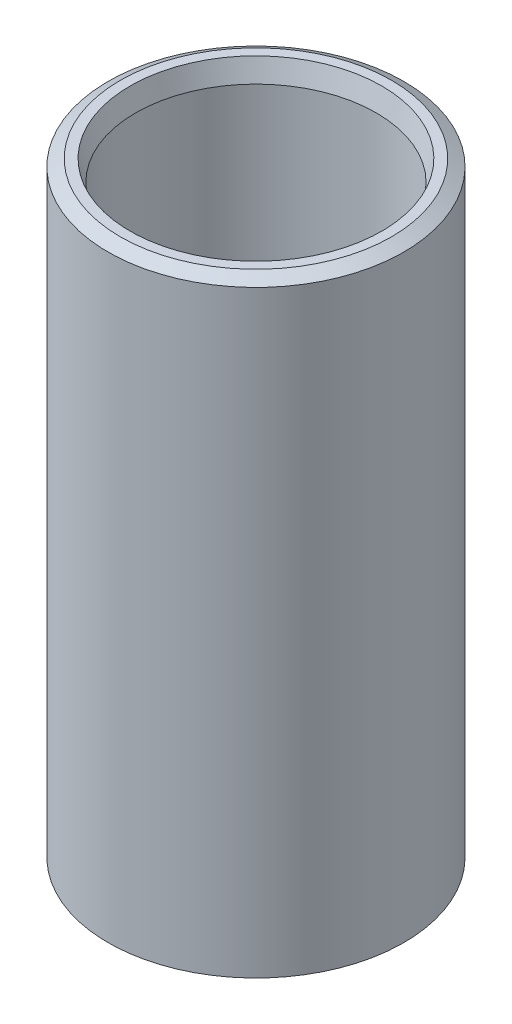
ISO-10303-21;
HEADER;
FILE_DESCRIPTION(('STEP AP214'),'2;1');
FILE_NAME('part.step','',(''),(''),'','','');
FILE_SCHEMA(('AUTOMOTIVE_DESIGN { 1 0 10303 214 1 1 1 1 }'));
ENDSEC;
DATA;
#1=APPLICATION_CONTEXT('core data for automotive mechanical design processes');
#2=APPLICATION_PROTOCOL_DEFINITION('international standard','automotive_design',2000,#1);
#3=PRODUCT_CONTEXT('',#1,'mechanical');
#4=PRODUCT('Part','Part','',(#3));
#5=PRODUCT_RELATED_PRODUCT_CATEGORY('part','',(#4));
#6=PRODUCT_DEFINITION_FORMATION('','',#4);
#7=PRODUCT_DEFINITION_CONTEXT('part definition',#1,'design');
#8=PRODUCT_DEFINITION('design','',#6,#7);
#9=PRODUCT_DEFINITION_SHAPE('','',#8);
#10=(LENGTH_UNIT() NAMED_UNIT(*) SI_UNIT(.MILLI.,.METRE.));
#11=(NAMED_UNIT(*) PLANE_ANGLE_UNIT() SI_UNIT($,.RADIAN.));
#12=(NAMED_UNIT(*) SI_UNIT($,.STERADIAN.) SOLID_ANGLE_UNIT());
#13=UNCERTAINTY_MEASURE_WITH_UNIT(LENGTH_MEASURE(1.E-05),#10,'distance_accuracy_value','');
#14=(GEOMETRIC_REPRESENTATION_CONTEXT(3) GLOBAL_UNCERTAINTY_ASSIGNED_CONTEXT((#13)) GLOBAL_UNIT_ASSIGNED_CONTEXT((#10,
#11,#12)) REPRESENTATION_CONTEXT('',''));
#15=CARTESIAN_POINT('',(0.,0.,0.));
#16=DIRECTION('',(0.,0.,1.));
#17=DIRECTION('',(1.,0.,0.));
#18=AXIS2_PLACEMENT_3D('',#15,#16,#17);
#19=CARTESIAN_POINT('',(0.,100.,0.));
#20=DIRECTION('',(0.,1.,0.));
#21=DIRECTION('',(0.,0.,1.));
#22=AXIS2_PLACEMENT_3D('',#19,#20,#21);
#23=PLANE('',#22);
#24=CARTESIAN_POINT('',(0.,100.,0.));
#25=DIRECTION('',(0.,-1.,0.));
#26=DIRECTION('',(0.,0.,-1.));
#27=AXIS2_PLACEMENT_3D('',#24,#25,#26);
#28=CIRCLE('',#27,20.55);
#29=CARTESIAN_POINT('',(0.,100.,-20.55));
#30=VERTEX_POINT('',#29);
#31=EDGE_CURVE('E43',#30,#30,#28,.T.);
#32=ORIENTED_EDGE('',*,*,#31,.T.);
#33=EDGE_LOOP('',(#32));
#34=FACE_BOUND('',#33,.T.);
#35=CARTESIAN_POINT('',(0.,100.,0.));
#36=DIRECTION('',(0.,-1.,0.));
#37=DIRECTION('',(0.,0.,-1.));
#38=AXIS2_PLACEMENT_3D('',#35,#36,#37);
#39=CIRCLE('',#38,22.15);
#40=CARTESIAN_POINT('',(0.,100.,-22.15));
#41=VERTEX_POINT('',#40);
#42=EDGE_CURVE('E39',#41,#41,#39,.T.);
#43=ORIENTED_EDGE('',*,*,#42,.F.);
#44=EDGE_LOOP('',(#43));
#45=FACE_BOUND('',#44,.T.);
#46=ADVANCED_FACE('F32',(#34,#45),#23,.T.);
#47=CARTESIAN_POINT('',(0.,0.,0.));
#48=DIRECTION('',(0.,1.,0.));
#49=DIRECTION('',(0.,0.,1.));
#50=AXIS2_PLACEMENT_3D('',#47,#48,#49);
#51=PLANE('',#50);
#52=CARTESIAN_POINT('',(0.,0.,0.));
#53=DIRECTION('',(0.,-1.,0.));
#54=DIRECTION('',(0.,0.,-1.));
#55=AXIS2_PLACEMENT_3D('',#52,#53,#54);
#56=CIRCLE('',#55,20.55);
#57=CARTESIAN_POINT('',(0.,0.,-20.55));
#58=VERTEX_POINT('',#57);
#59=EDGE_CURVE('E58',#58,#58,#56,.T.);
#60=ORIENTED_EDGE('',*,*,#59,.F.);
#61=EDGE_LOOP('',(#60));
#62=FACE_BOUND('',#61,.T.);
#63=CARTESIAN_POINT('',(0.,0.,0.));
#64=DIRECTION('',(0.,-1.,0.));
#65=DIRECTION('',(0.,0.,-1.));
#66=AXIS2_PLACEMENT_3D('',#63,#64,#65);
#67=CIRCLE('',#66,22.15);
#68=CARTESIAN_POINT('',(0.,0.,-22.15));
#69=VERTEX_POINT('',#68);
#70=EDGE_CURVE('E55',#69,#69,#67,.T.);
#71=ORIENTED_EDGE('',*,*,#70,.T.);
#72=EDGE_LOOP('',(#71));
#73=FACE_BOUND('',#72,.T.);
#74=ADVANCED_FACE('F75',(#62,#73),#51,.F.);
#75=CARTESIAN_POINT('',(0.,100.,0.));
#76=DIRECTION('',(0.,-1.,0.));
#77=DIRECTION('',(0.,0.,-1.));
#78=AXIS2_PLACEMENT_3D('',#75,#76,#77);
#79=CYLINDRICAL_SURFACE('',#78,24.15);
#80=CARTESIAN_POINT('',(0.,1.15470053837923,0.));
#81=DIRECTION('',(0.,-1.,0.));
#82=DIRECTION('',(0.,0.,-1.));
#83=AXIS2_PLACEMENT_3D('',#80,#81,#82);
#84=CIRCLE('',#83,24.15);
#85=CARTESIAN_POINT('',(0.,1.15470053837923,-24.15));
#86=VERTEX_POINT('',#85);
#87=EDGE_CURVE('E52',#86,#86,#84,.T.);
#88=ORIENTED_EDGE('',*,*,#87,.F.);
#89=EDGE_LOOP('',(#88));
#90=FACE_BOUND('',#89,.T.);
#91=CARTESIAN_POINT('',(0.,98.8452994616208,0.));
#92=DIRECTION('',(0.,-1.,0.));
#93=DIRECTION('',(0.,0.,-1.));
#94=AXIS2_PLACEMENT_3D('',#91,#92,#93);
#95=CIRCLE('',#94,24.15);
#96=CARTESIAN_POINT('',(0.,98.8452994616208,-24.15));
#97=VERTEX_POINT('',#96);
#98=EDGE_CURVE('E10',#97,#97,#95,.T.);
#99=ORIENTED_EDGE('',*,*,#98,.T.);
#100=EDGE_LOOP('',(#99));
#101=FACE_BOUND('',#100,.T.);
#102=ADVANCED_FACE('F34',(#90,#101),#79,.T.);
#103=CARTESIAN_POINT('',(0.,100.,0.));
#104=DIRECTION('',(0.,-1.,0.));
#105=DIRECTION('',(0.,0.,-1.));
#106=AXIS2_PLACEMENT_3D('',#103,#104,#105);
#107=CYLINDRICAL_SURFACE('',#106,19.65);
#108=CARTESIAN_POINT('',(0.,3.35884572681207,0.));
#109=DIRECTION('',(0.,-1.,0.));
#110=DIRECTION('',(0.,0.,-1.));
#111=AXIS2_PLACEMENT_3D('',#108,#109,#110);
#112=CIRCLE('',#111,19.65);
#113=CARTESIAN_POINT('',(0.,3.35884572681207,-19.65));
#114=VERTEX_POINT('',#113);
#115=EDGE_CURVE('E61',#114,#114,#112,.T.);
#116=ORIENTED_EDGE('',*,*,#115,.T.);
#117=EDGE_LOOP('',(#116));
#118=FACE_BOUND('',#117,.T.);
#119=CARTESIAN_POINT('',(0.,96.6411542731879,0.));
#120=DIRECTION('',(0.,-1.,0.));
#121=DIRECTION('',(0.,0.,-1.));
#122=AXIS2_PLACEMENT_3D('',#119,#120,#121);
#123=CIRCLE('',#122,19.65);
#124=CARTESIAN_POINT('',(0.,96.6411542731879,-19.65));
#125=VERTEX_POINT('',#124);
#126=EDGE_CURVE('E47',#125,#125,#123,.T.);
#127=ORIENTED_EDGE('',*,*,#126,.F.);
#128=EDGE_LOOP('',(#127));
#129=FACE_BOUND('',#128,.T.);
#130=ADVANCED_FACE('F65',(#118,#129),#107,.F.);
#131=CARTESIAN_POINT('',(0.,100.,0.));
#132=DIRECTION('',(0.,-1.,0.));
#133=DIRECTION('',(0.,0.,-1.));
#134=AXIS2_PLACEMENT_3D('',#131,#132,#133);
#135=CONICAL_SURFACE('',#134,22.15,1.04719755119661);
#136=ORIENTED_EDGE('',*,*,#98,.F.);
#137=EDGE_LOOP('',(#136));
#138=FACE_BOUND('',#137,.T.);
#139=ORIENTED_EDGE('',*,*,#42,.T.);
#140=EDGE_LOOP('',(#139));
#141=FACE_BOUND('',#140,.T.);
#142=ADVANCED_FACE('F90',(#138,#141),#135,.T.);
#143=CARTESIAN_POINT('',(0.,96.6411542731879,0.));
#144=DIRECTION('',(0.,1.,0.));
#145=DIRECTION('',(0.,0.,1.));
#146=AXIS2_PLACEMENT_3D('',#143,#144,#145);
#147=CONICAL_SURFACE('',#146,19.65,0.261799387799143);
#148=ORIENTED_EDGE('',*,*,#31,.F.);
#149=EDGE_LOOP('',(#148));
#150=FACE_BOUND('',#149,.T.);
#151=ORIENTED_EDGE('',*,*,#126,.T.);
#152=EDGE_LOOP('',(#151));
#153=FACE_BOUND('',#152,.T.);
#154=ADVANCED_FACE('F82',(#150,#153),#147,.F.);
#155=CARTESIAN_POINT('',(0.,1.15470053837923,0.));
#156=DIRECTION('',(0.,1.,0.));
#157=DIRECTION('',(0.,0.,1.));
#158=AXIS2_PLACEMENT_3D('',#155,#156,#157);
#159=CONICAL_SURFACE('',#158,24.15,1.0471975511966);
#160=ORIENTED_EDGE('',*,*,#70,.F.);
#161=EDGE_LOOP('',(#160));
#162=FACE_BOUND('',#161,.T.);
#163=ORIENTED_EDGE('',*,*,#87,.T.);
#164=EDGE_LOOP('',(#163));
#165=FACE_BOUND('',#164,.T.);
#166=ADVANCED_FACE('F71',(#162,#165),#159,.T.);
#167=CARTESIAN_POINT('',(0.,0.,0.));
#168=DIRECTION('',(0.,-1.,0.));
#169=DIRECTION('',(0.,0.,-1.));
#170=AXIS2_PLACEMENT_3D('',#167,#168,#169);
#171=CONICAL_SURFACE('',#170,20.55,0.261799387799145);
#172=ORIENTED_EDGE('',*,*,#115,.F.);
#173=EDGE_LOOP('',(#172));
#174=FACE_BOUND('',#173,.T.);
#175=ORIENTED_EDGE('',*,*,#59,.T.);
#176=EDGE_LOOP('',(#175));
#177=FACE_BOUND('',#176,.T.);
#178=ADVANCED_FACE('F68',(#174,#177),#171,.F.);
#179=CLOSED_SHELL('',(#46,#74,#102,#130,#142,#154,#166,#178));
#180=MANIFOLD_SOLID_BREP('B2',#179);
#181=ADVANCED_BREP_SHAPE_REPRESENTATION('',(#18,#180),#14);
#182=SHAPE_DEFINITION_REPRESENTATION(#9,#181);
ENDSEC;
END-ISO-10303-21;
